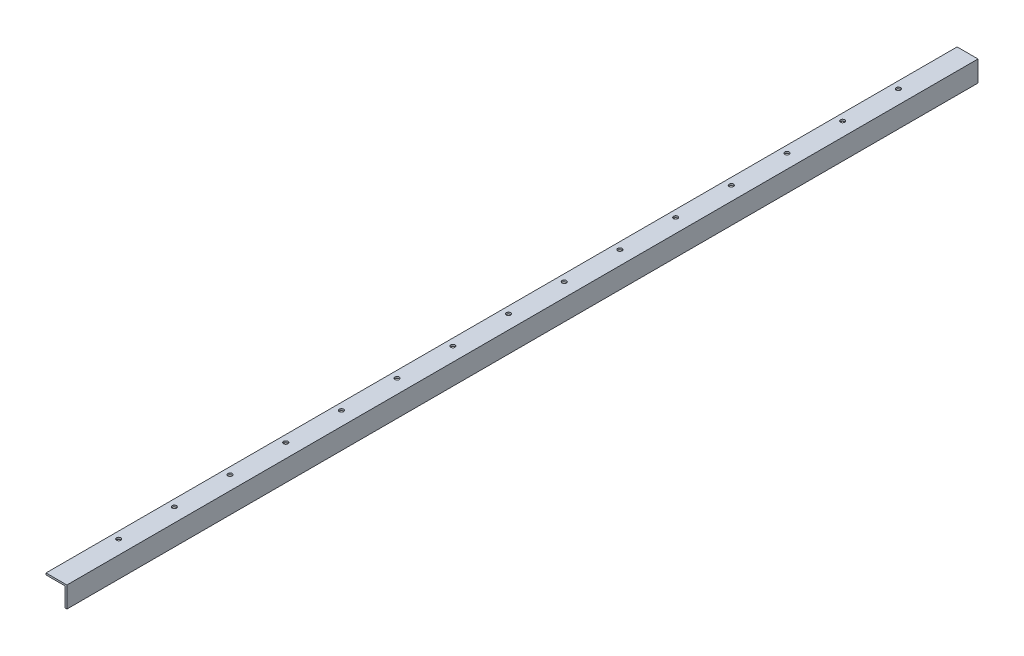
ISO-10303-21;
HEADER;
FILE_DESCRIPTION(('STEP AP214'),'2;1');
FILE_NAME('part.step','',(''),(''),'','','');
FILE_SCHEMA(('AUTOMOTIVE_DESIGN { 1 0 10303 214 1 1 1 1 }'));
ENDSEC;
DATA;
#1=APPLICATION_CONTEXT('core data for automotive mechanical design processes');
#2=APPLICATION_PROTOCOL_DEFINITION('international standard','automotive_design',2000,#1);
#3=PRODUCT_CONTEXT('',#1,'mechanical');
#4=PRODUCT('Part','Part','',(#3));
#5=PRODUCT_RELATED_PRODUCT_CATEGORY('part','',(#4));
#6=PRODUCT_DEFINITION_FORMATION('','',#4);
#7=PRODUCT_DEFINITION_CONTEXT('part definition',#1,'design');
#8=PRODUCT_DEFINITION('design','',#6,#7);
#9=PRODUCT_DEFINITION_SHAPE('','',#8);
#10=(LENGTH_UNIT() NAMED_UNIT(*) SI_UNIT(.MILLI.,.METRE.));
#11=(NAMED_UNIT(*) PLANE_ANGLE_UNIT() SI_UNIT($,.RADIAN.));
#12=(NAMED_UNIT(*) SI_UNIT($,.STERADIAN.) SOLID_ANGLE_UNIT());
#13=UNCERTAINTY_MEASURE_WITH_UNIT(LENGTH_MEASURE(1.E-05),#10,'distance_accuracy_value','');
#14=(GEOMETRIC_REPRESENTATION_CONTEXT(3) GLOBAL_UNCERTAINTY_ASSIGNED_CONTEXT((#13)) GLOBAL_UNIT_ASSIGNED_CONTEXT((#10,
#11,#12)) REPRESENTATION_CONTEXT('',''));
#15=CARTESIAN_POINT('',(0.,0.,0.));
#16=DIRECTION('',(0.,0.,1.));
#17=DIRECTION('',(1.,0.,0.));
#18=AXIS2_PLACEMENT_3D('',#15,#16,#17);
#19=CARTESIAN_POINT('',(-25.4,-41.275,1542.25625));
#20=DIRECTION('',(0.,1.,0.));
#21=DIRECTION('',(0.,0.,1.));
#22=AXIS2_PLACEMENT_3D('',#19,#20,#21);
#23=CYLINDRICAL_SURFACE('',#22,3.96874999999999);
#24=CARTESIAN_POINT('',(-25.4,-3.175,1542.25625));
#25=DIRECTION('',(0.,1.,0.));
#26=DIRECTION('',(0.,0.,1.));
#27=AXIS2_PLACEMENT_3D('',#24,#25,#26);
#28=CIRCLE('',#27,3.96874999999999);
#29=CARTESIAN_POINT('',(-25.4,-3.175,1546.225));
#30=VERTEX_POINT('',#29);
#31=EDGE_CURVE('E40',#30,#30,#28,.T.);
#32=ORIENTED_EDGE('',*,*,#31,.F.);
#33=EDGE_LOOP('',(#32));
#34=FACE_BOUND('',#33,.T.);
#35=CARTESIAN_POINT('',(-25.4,0.,1542.25625));
#36=DIRECTION('',(0.,-1.,0.));
#37=DIRECTION('',(1.,0.,0.));
#38=AXIS2_PLACEMENT_3D('',#35,#36,#37);
#39=CIRCLE('',#38,3.96874999999999);
#40=CARTESIAN_POINT('',(-21.43125,0.,1542.25625));
#41=VERTEX_POINT('',#40);
#42=EDGE_CURVE('E11',#41,#41,#39,.T.);
#43=ORIENTED_EDGE('',*,*,#42,.F.);
#44=EDGE_LOOP('',(#43));
#45=FACE_BOUND('',#44,.T.);
#46=ADVANCED_FACE('F32',(#34,#45),#23,.F.);
#47=CARTESIAN_POINT('',(-25.4,-41.275,1440.65625));
#48=DIRECTION('',(0.,1.,0.));
#49=DIRECTION('',(0.,0.,1.));
#50=AXIS2_PLACEMENT_3D('',#47,#48,#49);
#51=CYLINDRICAL_SURFACE('',#50,3.96874999999999);
#52=CARTESIAN_POINT('',(-25.4,-3.175,1440.65625));
#53=DIRECTION('',(0.,1.,0.));
#54=DIRECTION('',(0.,0.,1.));
#55=AXIS2_PLACEMENT_3D('',#52,#53,#54);
#56=CIRCLE('',#55,3.96874999999999);
#57=CARTESIAN_POINT('',(-25.4,-3.175,1444.625));
#58=VERTEX_POINT('',#57);
#59=EDGE_CURVE('E208',#58,#58,#56,.T.);
#60=ORIENTED_EDGE('',*,*,#59,.F.);
#61=EDGE_LOOP('',(#60));
#62=FACE_BOUND('',#61,.T.);
#63=CARTESIAN_POINT('',(-25.4,0.,1440.65625));
#64=DIRECTION('',(0.,-1.,0.));
#65=DIRECTION('',(1.,0.,0.));
#66=AXIS2_PLACEMENT_3D('',#63,#64,#65);
#67=CIRCLE('',#66,3.96874999999999);
#68=CARTESIAN_POINT('',(-21.43125,0.,1440.65625));
#69=VERTEX_POINT('',#68);
#70=EDGE_CURVE('E211',#69,#69,#67,.T.);
#71=ORIENTED_EDGE('',*,*,#70,.F.);
#72=EDGE_LOOP('',(#71));
#73=FACE_BOUND('',#72,.T.);
#74=ADVANCED_FACE('F219',(#62,#73),#51,.F.);
#75=CARTESIAN_POINT('',(-25.4,-41.275,1339.05625));
#76=DIRECTION('',(0.,1.,0.));
#77=DIRECTION('',(0.,0.,1.));
#78=AXIS2_PLACEMENT_3D('',#75,#76,#77);
#79=CYLINDRICAL_SURFACE('',#78,3.96874999999999);
#80=CARTESIAN_POINT('',(-25.4,-3.175,1339.05625));
#81=DIRECTION('',(0.,1.,0.));
#82=DIRECTION('',(0.,0.,1.));
#83=AXIS2_PLACEMENT_3D('',#80,#81,#82);
#84=CIRCLE('',#83,3.96874999999999);
#85=CARTESIAN_POINT('',(-25.4,-3.175,1343.025));
#86=VERTEX_POINT('',#85);
#87=EDGE_CURVE('E202',#86,#86,#84,.T.);
#88=ORIENTED_EDGE('',*,*,#87,.F.);
#89=EDGE_LOOP('',(#88));
#90=FACE_BOUND('',#89,.T.);
#91=CARTESIAN_POINT('',(-25.4,0.,1339.05625));
#92=DIRECTION('',(0.,-1.,0.));
#93=DIRECTION('',(1.,0.,0.));
#94=AXIS2_PLACEMENT_3D('',#91,#92,#93);
#95=CIRCLE('',#94,3.96874999999999);
#96=CARTESIAN_POINT('',(-21.43125,0.,1339.05625));
#97=VERTEX_POINT('',#96);
#98=EDGE_CURVE('E205',#97,#97,#95,.T.);
#99=ORIENTED_EDGE('',*,*,#98,.F.);
#100=EDGE_LOOP('',(#99));
#101=FACE_BOUND('',#100,.T.);
#102=ADVANCED_FACE('F279',(#90,#101),#79,.F.);
#103=CARTESIAN_POINT('',(-25.4,-41.275,1237.45625));
#104=DIRECTION('',(0.,1.,0.));
#105=DIRECTION('',(0.,0.,1.));
#106=AXIS2_PLACEMENT_3D('',#103,#104,#105);
#107=CYLINDRICAL_SURFACE('',#106,3.96874999999999);
#108=CARTESIAN_POINT('',(-25.4,-3.175,1237.45625));
#109=DIRECTION('',(0.,1.,0.));
#110=DIRECTION('',(0.,0.,1.));
#111=AXIS2_PLACEMENT_3D('',#108,#109,#110);
#112=CIRCLE('',#111,3.96874999999999);
#113=CARTESIAN_POINT('',(-25.4,-3.175,1241.425));
#114=VERTEX_POINT('',#113);
#115=EDGE_CURVE('E196',#114,#114,#112,.T.);
#116=ORIENTED_EDGE('',*,*,#115,.F.);
#117=EDGE_LOOP('',(#116));
#118=FACE_BOUND('',#117,.T.);
#119=CARTESIAN_POINT('',(-25.4,0.,1237.45625));
#120=DIRECTION('',(0.,-1.,0.));
#121=DIRECTION('',(1.,0.,0.));
#122=AXIS2_PLACEMENT_3D('',#119,#120,#121);
#123=CIRCLE('',#122,3.96874999999999);
#124=CARTESIAN_POINT('',(-21.43125,0.,1237.45625));
#125=VERTEX_POINT('',#124);
#126=EDGE_CURVE('E199',#125,#125,#123,.T.);
#127=ORIENTED_EDGE('',*,*,#126,.F.);
#128=EDGE_LOOP('',(#127));
#129=FACE_BOUND('',#128,.T.);
#130=ADVANCED_FACE('F275',(#118,#129),#107,.F.);
#131=CARTESIAN_POINT('',(-25.4,-41.275,1135.85625));
#132=DIRECTION('',(0.,1.,0.));
#133=DIRECTION('',(0.,0.,1.));
#134=AXIS2_PLACEMENT_3D('',#131,#132,#133);
#135=CYLINDRICAL_SURFACE('',#134,3.96874999999999);
#136=CARTESIAN_POINT('',(-25.4,-3.175,1135.85625));
#137=DIRECTION('',(0.,1.,0.));
#138=DIRECTION('',(0.,0.,1.));
#139=AXIS2_PLACEMENT_3D('',#136,#137,#138);
#140=CIRCLE('',#139,3.96874999999999);
#141=CARTESIAN_POINT('',(-25.4,-3.175,1139.825));
#142=VERTEX_POINT('',#141);
#143=EDGE_CURVE('E190',#142,#142,#140,.T.);
#144=ORIENTED_EDGE('',*,*,#143,.F.);
#145=EDGE_LOOP('',(#144));
#146=FACE_BOUND('',#145,.T.);
#147=CARTESIAN_POINT('',(-25.4,0.,1135.85625));
#148=DIRECTION('',(0.,-1.,0.));
#149=DIRECTION('',(1.,0.,0.));
#150=AXIS2_PLACEMENT_3D('',#147,#148,#149);
#151=CIRCLE('',#150,3.96874999999999);
#152=CARTESIAN_POINT('',(-21.43125,0.,1135.85625));
#153=VERTEX_POINT('',#152);
#154=EDGE_CURVE('E193',#153,#153,#151,.T.);
#155=ORIENTED_EDGE('',*,*,#154,.F.);
#156=EDGE_LOOP('',(#155));
#157=FACE_BOUND('',#156,.T.);
#158=ADVANCED_FACE('F271',(#146,#157),#135,.F.);
#159=CARTESIAN_POINT('',(-25.4,-41.275,1034.25625));
#160=DIRECTION('',(0.,1.,0.));
#161=DIRECTION('',(0.,0.,1.));
#162=AXIS2_PLACEMENT_3D('',#159,#160,#161);
#163=CYLINDRICAL_SURFACE('',#162,3.96874999999999);
#164=CARTESIAN_POINT('',(-25.4,-3.175,1034.25625));
#165=DIRECTION('',(0.,1.,0.));
#166=DIRECTION('',(0.,0.,1.));
#167=AXIS2_PLACEMENT_3D('',#164,#165,#166);
#168=CIRCLE('',#167,3.96874999999999);
#169=CARTESIAN_POINT('',(-25.4,-3.175,1038.225));
#170=VERTEX_POINT('',#169);
#171=EDGE_CURVE('E184',#170,#170,#168,.T.);
#172=ORIENTED_EDGE('',*,*,#171,.F.);
#173=EDGE_LOOP('',(#172));
#174=FACE_BOUND('',#173,.T.);
#175=CARTESIAN_POINT('',(-25.4,0.,1034.25625));
#176=DIRECTION('',(0.,-1.,0.));
#177=DIRECTION('',(1.,0.,0.));
#178=AXIS2_PLACEMENT_3D('',#175,#176,#177);
#179=CIRCLE('',#178,3.96874999999999);
#180=CARTESIAN_POINT('',(-21.43125,0.,1034.25625));
#181=VERTEX_POINT('',#180);
#182=EDGE_CURVE('E187',#181,#181,#179,.T.);
#183=ORIENTED_EDGE('',*,*,#182,.F.);
#184=EDGE_LOOP('',(#183));
#185=FACE_BOUND('',#184,.T.);
#186=ADVANCED_FACE('F267',(#174,#185),#163,.F.);
#187=CARTESIAN_POINT('',(-25.4,-41.275,932.65625));
#188=DIRECTION('',(0.,1.,0.));
#189=DIRECTION('',(0.,0.,1.));
#190=AXIS2_PLACEMENT_3D('',#187,#188,#189);
#191=CYLINDRICAL_SURFACE('',#190,3.96874999999999);
#192=CARTESIAN_POINT('',(-25.4,-3.175,932.65625));
#193=DIRECTION('',(0.,1.,0.));
#194=DIRECTION('',(0.,0.,1.));
#195=AXIS2_PLACEMENT_3D('',#192,#193,#194);
#196=CIRCLE('',#195,3.96874999999999);
#197=CARTESIAN_POINT('',(-25.4,-3.175,936.625));
#198=VERTEX_POINT('',#197);
#199=EDGE_CURVE('E178',#198,#198,#196,.T.);
#200=ORIENTED_EDGE('',*,*,#199,.F.);
#201=EDGE_LOOP('',(#200));
#202=FACE_BOUND('',#201,.T.);
#203=CARTESIAN_POINT('',(-25.4,0.,932.65625));
#204=DIRECTION('',(0.,-1.,0.));
#205=DIRECTION('',(1.,0.,0.));
#206=AXIS2_PLACEMENT_3D('',#203,#204,#205);
#207=CIRCLE('',#206,3.96874999999999);
#208=CARTESIAN_POINT('',(-21.43125,0.,932.65625));
#209=VERTEX_POINT('',#208);
#210=EDGE_CURVE('E181',#209,#209,#207,.T.);
#211=ORIENTED_EDGE('',*,*,#210,.F.);
#212=EDGE_LOOP('',(#211));
#213=FACE_BOUND('',#212,.T.);
#214=ADVANCED_FACE('F263',(#202,#213),#191,.F.);
#215=CARTESIAN_POINT('',(-25.4,-41.275,831.05625));
#216=DIRECTION('',(0.,1.,0.));
#217=DIRECTION('',(0.,0.,1.));
#218=AXIS2_PLACEMENT_3D('',#215,#216,#217);
#219=CYLINDRICAL_SURFACE('',#218,3.96874999999999);
#220=CARTESIAN_POINT('',(-25.4,-3.175,831.05625));
#221=DIRECTION('',(0.,1.,0.));
#222=DIRECTION('',(0.,0.,1.));
#223=AXIS2_PLACEMENT_3D('',#220,#221,#222);
#224=CIRCLE('',#223,3.96874999999999);
#225=CARTESIAN_POINT('',(-25.4,-3.175,835.025));
#226=VERTEX_POINT('',#225);
#227=EDGE_CURVE('E172',#226,#226,#224,.T.);
#228=ORIENTED_EDGE('',*,*,#227,.F.);
#229=EDGE_LOOP('',(#228));
#230=FACE_BOUND('',#229,.T.);
#231=CARTESIAN_POINT('',(-25.4,0.,831.05625));
#232=DIRECTION('',(0.,-1.,0.));
#233=DIRECTION('',(1.,0.,0.));
#234=AXIS2_PLACEMENT_3D('',#231,#232,#233);
#235=CIRCLE('',#234,3.96874999999999);
#236=CARTESIAN_POINT('',(-21.43125,0.,831.05625));
#237=VERTEX_POINT('',#236);
#238=EDGE_CURVE('E175',#237,#237,#235,.T.);
#239=ORIENTED_EDGE('',*,*,#238,.F.);
#240=EDGE_LOOP('',(#239));
#241=FACE_BOUND('',#240,.T.);
#242=ADVANCED_FACE('F259',(#230,#241),#219,.F.);
#243=CARTESIAN_POINT('',(-25.4,-41.275,729.45625));
#244=DIRECTION('',(0.,1.,0.));
#245=DIRECTION('',(0.,0.,1.));
#246=AXIS2_PLACEMENT_3D('',#243,#244,#245);
#247=CYLINDRICAL_SURFACE('',#246,3.96874999999999);
#248=CARTESIAN_POINT('',(-25.4,-3.175,729.45625));
#249=DIRECTION('',(0.,1.,0.));
#250=DIRECTION('',(0.,0.,1.));
#251=AXIS2_PLACEMENT_3D('',#248,#249,#250);
#252=CIRCLE('',#251,3.96874999999999);
#253=CARTESIAN_POINT('',(-25.4,-3.175,733.425));
#254=VERTEX_POINT('',#253);
#255=EDGE_CURVE('E166',#254,#254,#252,.T.);
#256=ORIENTED_EDGE('',*,*,#255,.F.);
#257=EDGE_LOOP('',(#256));
#258=FACE_BOUND('',#257,.T.);
#259=CARTESIAN_POINT('',(-25.4,0.,729.45625));
#260=DIRECTION('',(0.,-1.,0.));
#261=DIRECTION('',(1.,0.,0.));
#262=AXIS2_PLACEMENT_3D('',#259,#260,#261);
#263=CIRCLE('',#262,3.96874999999999);
#264=CARTESIAN_POINT('',(-21.43125,0.,729.45625));
#265=VERTEX_POINT('',#264);
#266=EDGE_CURVE('E169',#265,#265,#263,.T.);
#267=ORIENTED_EDGE('',*,*,#266,.F.);
#268=EDGE_LOOP('',(#267));
#269=FACE_BOUND('',#268,.T.);
#270=ADVANCED_FACE('F255',(#258,#269),#247,.F.);
#271=CARTESIAN_POINT('',(-25.4,-41.275,627.85625));
#272=DIRECTION('',(0.,1.,0.));
#273=DIRECTION('',(0.,0.,1.));
#274=AXIS2_PLACEMENT_3D('',#271,#272,#273);
#275=CYLINDRICAL_SURFACE('',#274,3.96874999999999);
#276=CARTESIAN_POINT('',(-25.4,-3.175,627.85625));
#277=DIRECTION('',(0.,1.,0.));
#278=DIRECTION('',(0.,0.,1.));
#279=AXIS2_PLACEMENT_3D('',#276,#277,#278);
#280=CIRCLE('',#279,3.96874999999999);
#281=CARTESIAN_POINT('',(-25.4,-3.175,631.825));
#282=VERTEX_POINT('',#281);
#283=EDGE_CURVE('E160',#282,#282,#280,.T.);
#284=ORIENTED_EDGE('',*,*,#283,.F.);
#285=EDGE_LOOP('',(#284));
#286=FACE_BOUND('',#285,.T.);
#287=CARTESIAN_POINT('',(-25.4,0.,627.85625));
#288=DIRECTION('',(0.,-1.,0.));
#289=DIRECTION('',(1.,0.,0.));
#290=AXIS2_PLACEMENT_3D('',#287,#288,#289);
#291=CIRCLE('',#290,3.96874999999999);
#292=CARTESIAN_POINT('',(-21.43125,0.,627.85625));
#293=VERTEX_POINT('',#292);
#294=EDGE_CURVE('E163',#293,#293,#291,.T.);
#295=ORIENTED_EDGE('',*,*,#294,.F.);
#296=EDGE_LOOP('',(#295));
#297=FACE_BOUND('',#296,.T.);
#298=ADVANCED_FACE('F251',(#286,#297),#275,.F.);
#299=CARTESIAN_POINT('',(-25.4,-41.275,526.25625));
#300=DIRECTION('',(0.,1.,0.));
#301=DIRECTION('',(0.,0.,1.));
#302=AXIS2_PLACEMENT_3D('',#299,#300,#301);
#303=CYLINDRICAL_SURFACE('',#302,3.96874999999999);
#304=CARTESIAN_POINT('',(-25.4,-3.175,526.25625));
#305=DIRECTION('',(0.,1.,0.));
#306=DIRECTION('',(0.,0.,1.));
#307=AXIS2_PLACEMENT_3D('',#304,#305,#306);
#308=CIRCLE('',#307,3.96874999999999);
#309=CARTESIAN_POINT('',(-25.4,-3.175,530.225));
#310=VERTEX_POINT('',#309);
#311=EDGE_CURVE('E154',#310,#310,#308,.T.);
#312=ORIENTED_EDGE('',*,*,#311,.F.);
#313=EDGE_LOOP('',(#312));
#314=FACE_BOUND('',#313,.T.);
#315=CARTESIAN_POINT('',(-25.4,0.,526.25625));
#316=DIRECTION('',(0.,-1.,0.));
#317=DIRECTION('',(1.,0.,0.));
#318=AXIS2_PLACEMENT_3D('',#315,#316,#317);
#319=CIRCLE('',#318,3.96874999999999);
#320=CARTESIAN_POINT('',(-21.43125,0.,526.25625));
#321=VERTEX_POINT('',#320);
#322=EDGE_CURVE('E157',#321,#321,#319,.T.);
#323=ORIENTED_EDGE('',*,*,#322,.F.);
#324=EDGE_LOOP('',(#323));
#325=FACE_BOUND('',#324,.T.);
#326=ADVANCED_FACE('F247',(#314,#325),#303,.F.);
#327=CARTESIAN_POINT('',(-25.4,-41.275,424.65625));
#328=DIRECTION('',(0.,1.,0.));
#329=DIRECTION('',(0.,0.,1.));
#330=AXIS2_PLACEMENT_3D('',#327,#328,#329);
#331=CYLINDRICAL_SURFACE('',#330,3.96874999999999);
#332=CARTESIAN_POINT('',(-25.4,-3.175,424.65625));
#333=DIRECTION('',(0.,1.,0.));
#334=DIRECTION('',(0.,0.,1.));
#335=AXIS2_PLACEMENT_3D('',#332,#333,#334);
#336=CIRCLE('',#335,3.96874999999999);
#337=CARTESIAN_POINT('',(-25.4,-3.175,428.625));
#338=VERTEX_POINT('',#337);
#339=EDGE_CURVE('E148',#338,#338,#336,.T.);
#340=ORIENTED_EDGE('',*,*,#339,.F.);
#341=EDGE_LOOP('',(#340));
#342=FACE_BOUND('',#341,.T.);
#343=CARTESIAN_POINT('',(-25.4,0.,424.65625));
#344=DIRECTION('',(0.,-1.,0.));
#345=DIRECTION('',(1.,0.,0.));
#346=AXIS2_PLACEMENT_3D('',#343,#344,#345);
#347=CIRCLE('',#346,3.96874999999999);
#348=CARTESIAN_POINT('',(-21.43125,0.,424.65625));
#349=VERTEX_POINT('',#348);
#350=EDGE_CURVE('E151',#349,#349,#347,.T.);
#351=ORIENTED_EDGE('',*,*,#350,.F.);
#352=EDGE_LOOP('',(#351));
#353=FACE_BOUND('',#352,.T.);
#354=ADVANCED_FACE('F243',(#342,#353),#331,.F.);
#355=CARTESIAN_POINT('',(-25.4,-41.275,323.05625));
#356=DIRECTION('',(0.,1.,0.));
#357=DIRECTION('',(0.,0.,1.));
#358=AXIS2_PLACEMENT_3D('',#355,#356,#357);
#359=CYLINDRICAL_SURFACE('',#358,3.96874999999999);
#360=CARTESIAN_POINT('',(-25.4,-3.175,323.05625));
#361=DIRECTION('',(0.,1.,0.));
#362=DIRECTION('',(0.,0.,1.));
#363=AXIS2_PLACEMENT_3D('',#360,#361,#362);
#364=CIRCLE('',#363,3.96874999999999);
#365=CARTESIAN_POINT('',(-25.4,-3.175,327.025));
#366=VERTEX_POINT('',#365);
#367=EDGE_CURVE('E138',#366,#366,#364,.T.);
#368=ORIENTED_EDGE('',*,*,#367,.F.);
#369=EDGE_LOOP('',(#368));
#370=FACE_BOUND('',#369,.T.);
#371=CARTESIAN_POINT('',(-25.4,0.,323.05625));
#372=DIRECTION('',(0.,-1.,0.));
#373=DIRECTION('',(1.,0.,0.));
#374=AXIS2_PLACEMENT_3D('',#371,#372,#373);
#375=CIRCLE('',#374,3.96874999999999);
#376=CARTESIAN_POINT('',(-21.43125,0.,323.05625));
#377=VERTEX_POINT('',#376);
#378=EDGE_CURVE('E145',#377,#377,#375,.T.);
#379=ORIENTED_EDGE('',*,*,#378,.F.);
#380=EDGE_LOOP('',(#379));
#381=FACE_BOUND('',#380,.T.);
#382=ADVANCED_FACE('F234',(#370,#381),#359,.F.);
#383=CARTESIAN_POINT('',(0.,-38.1,1662.1125));
#384=DIRECTION('',(-1.,0.,0.));
#385=DIRECTION('',(0.,0.,1.));
#386=AXIS2_PLACEMENT_3D('',#383,#384,#385);
#387=PLANE('',#386);
#388=DIRECTION('',(0.,1.,0.));
#389=VECTOR('',#388,1.);
#390=CARTESIAN_POINT('',(0.,-38.1,0.));
#391=LINE('',#390,#389);
#392=CARTESIAN_POINT('',(0.,-38.1,0.));
#393=VERTEX_POINT('',#392);
#394=CARTESIAN_POINT('',(0.,0.,0.));
#395=VERTEX_POINT('',#394);
#396=EDGE_CURVE('E118',#393,#395,#391,.T.);
#397=ORIENTED_EDGE('',*,*,#396,.T.);
#398=DIRECTION('',(0.,0.,-1.));
#399=VECTOR('',#398,1.);
#400=CARTESIAN_POINT('',(0.,0.,1662.1125));
#401=LINE('',#400,#399);
#402=CARTESIAN_POINT('',(0.,0.,1662.1125));
#403=VERTEX_POINT('',#402);
#404=EDGE_CURVE('E136',#403,#395,#401,.T.);
#405=ORIENTED_EDGE('',*,*,#404,.F.);
#406=DIRECTION('',(0.,1.,0.));
#407=VECTOR('',#406,1.);
#408=CARTESIAN_POINT('',(0.,-38.1,1662.1125));
#409=LINE('',#408,#407);
#410=CARTESIAN_POINT('',(0.,-38.1,1662.1125));
#411=VERTEX_POINT('',#410);
#412=EDGE_CURVE('E129',#411,#403,#409,.T.);
#413=ORIENTED_EDGE('',*,*,#412,.F.);
#414=DIRECTION('',(0.,0.,-1.));
#415=VECTOR('',#414,1.);
#416=CARTESIAN_POINT('',(0.,-38.1,1662.1125));
#417=LINE('',#416,#415);
#418=EDGE_CURVE('E114',#411,#393,#417,.T.);
#419=ORIENTED_EDGE('',*,*,#418,.T.);
#420=EDGE_LOOP('',(#397,#405,#413,#419));
#421=FACE_BOUND('',#420,.T.);
#422=ADVANCED_FACE('F225',(#421),#387,.F.);
#423=CARTESIAN_POINT('',(0.,0.,1662.1125));
#424=DIRECTION('',(0.,-1.,0.));
#425=DIRECTION('',(1.,0.,0.));
#426=AXIS2_PLACEMENT_3D('',#423,#424,#425);
#427=PLANE('',#426);
#428=CARTESIAN_POINT('',(-25.4,0.,221.45625));
#429=DIRECTION('',(0.,-1.,0.));
#430=DIRECTION('',(1.,0.,0.));
#431=AXIS2_PLACEMENT_3D('',#428,#429,#430);
#432=CIRCLE('',#431,3.96874999999999);
#433=CARTESIAN_POINT('',(-21.43125,0.,221.45625));
#434=VERTEX_POINT('',#433);
#435=EDGE_CURVE('E142',#434,#434,#432,.T.);
#436=ORIENTED_EDGE('',*,*,#435,.T.);
#437=EDGE_LOOP('',(#436));
#438=FACE_BOUND('',#437,.T.);
#439=CARTESIAN_POINT('',(-25.4,0.,119.85625));
#440=DIRECTION('',(0.,-1.,0.));
#441=DIRECTION('',(1.,0.,0.));
#442=AXIS2_PLACEMENT_3D('',#439,#440,#441);
#443=CIRCLE('',#442,3.96874999999999);
#444=CARTESIAN_POINT('',(-21.43125,0.,119.85625));
#445=VERTEX_POINT('',#444);
#446=EDGE_CURVE('E122',#445,#445,#443,.T.);
#447=ORIENTED_EDGE('',*,*,#446,.T.);
#448=EDGE_LOOP('',(#447));
#449=FACE_BOUND('',#448,.T.);
#450=DIRECTION('',(-1.,0.,0.));
#451=VECTOR('',#450,1.);
#452=CARTESIAN_POINT('',(0.,0.,0.));
#453=LINE('',#452,#451);
#454=CARTESIAN_POINT('',(-38.1,0.,0.));
#455=VERTEX_POINT('',#454);
#456=EDGE_CURVE('E121',#395,#455,#453,.T.);
#457=ORIENTED_EDGE('',*,*,#456,.T.);
#458=DIRECTION('',(0.,0.,-1.));
#459=VECTOR('',#458,1.);
#460=CARTESIAN_POINT('',(-38.1,0.,1662.1125));
#461=LINE('',#460,#459);
#462=CARTESIAN_POINT('',(-38.1,0.,1662.1125));
#463=VERTEX_POINT('',#462);
#464=EDGE_CURVE('E133',#463,#455,#461,.T.);
#465=ORIENTED_EDGE('',*,*,#464,.F.);
#466=DIRECTION('',(-1.,0.,0.));
#467=VECTOR('',#466,1.);
#468=CARTESIAN_POINT('',(0.,0.,1662.1125));
#469=LINE('',#468,#467);
#470=EDGE_CURVE('E86',#403,#463,#469,.T.);
#471=ORIENTED_EDGE('',*,*,#470,.F.);
#472=ORIENTED_EDGE('',*,*,#404,.T.);
#473=EDGE_LOOP('',(#457,#465,#471,#472));
#474=FACE_BOUND('',#473,.T.);
#475=ORIENTED_EDGE('',*,*,#378,.T.);
#476=EDGE_LOOP('',(#475));
#477=FACE_BOUND('',#476,.T.);
#478=ORIENTED_EDGE('',*,*,#350,.T.);
#479=EDGE_LOOP('',(#478));
#480=FACE_BOUND('',#479,.T.);
#481=ORIENTED_EDGE('',*,*,#322,.T.);
#482=EDGE_LOOP('',(#481));
#483=FACE_BOUND('',#482,.T.);
#484=ORIENTED_EDGE('',*,*,#294,.T.);
#485=EDGE_LOOP('',(#484));
#486=FACE_BOUND('',#485,.T.);
#487=ORIENTED_EDGE('',*,*,#266,.T.);
#488=EDGE_LOOP('',(#487));
#489=FACE_BOUND('',#488,.T.);
#490=ORIENTED_EDGE('',*,*,#238,.T.);
#491=EDGE_LOOP('',(#490));
#492=FACE_BOUND('',#491,.T.);
#493=ORIENTED_EDGE('',*,*,#210,.T.);
#494=EDGE_LOOP('',(#493));
#495=FACE_BOUND('',#494,.T.);
#496=ORIENTED_EDGE('',*,*,#182,.T.);
#497=EDGE_LOOP('',(#496));
#498=FACE_BOUND('',#497,.T.);
#499=ORIENTED_EDGE('',*,*,#154,.T.);
#500=EDGE_LOOP('',(#499));
#501=FACE_BOUND('',#500,.T.);
#502=ORIENTED_EDGE('',*,*,#126,.T.);
#503=EDGE_LOOP('',(#502));
#504=FACE_BOUND('',#503,.T.);
#505=ORIENTED_EDGE('',*,*,#98,.T.);
#506=EDGE_LOOP('',(#505));
#507=FACE_BOUND('',#506,.T.);
#508=ORIENTED_EDGE('',*,*,#70,.T.);
#509=EDGE_LOOP('',(#508));
#510=FACE_BOUND('',#509,.T.);
#511=ORIENTED_EDGE('',*,*,#42,.T.);
#512=EDGE_LOOP('',(#511));
#513=FACE_BOUND('',#512,.T.);
#514=ADVANCED_FACE('F222',(#438,#449,#474,#477,#480,#483,#486,#489,#492,#495,#498,#501,#504,
#507,#510,#513),#427,.F.);
#515=CARTESIAN_POINT('',(-38.1,0.,1662.1125));
#516=DIRECTION('',(1.,0.,0.));
#517=DIRECTION('',(0.,0.,-1.));
#518=AXIS2_PLACEMENT_3D('',#515,#516,#517);
#519=PLANE('',#518);
#520=DIRECTION('',(0.,-1.,0.));
#521=VECTOR('',#520,1.);
#522=CARTESIAN_POINT('',(-38.1,0.,0.));
#523=LINE('',#522,#521);
#524=CARTESIAN_POINT('',(-38.1,-3.17500000000001,0.));
#525=VERTEX_POINT('',#524);
#526=EDGE_CURVE('E124',#455,#525,#523,.T.);
#527=ORIENTED_EDGE('',*,*,#526,.T.);
#528=DIRECTION('',(0.,0.,-1.));
#529=VECTOR('',#528,1.);
#530=CARTESIAN_POINT('',(-38.1,-3.17500000000001,1662.1125));
#531=LINE('',#530,#529);
#532=CARTESIAN_POINT('',(-38.1,-3.17500000000001,1662.1125));
#533=VERTEX_POINT('',#532);
#534=EDGE_CURVE('E109',#533,#525,#531,.T.);
#535=ORIENTED_EDGE('',*,*,#534,.F.);
#536=DIRECTION('',(0.,-1.,0.));
#537=VECTOR('',#536,1.);
#538=CARTESIAN_POINT('',(-38.1,0.,1662.1125));
#539=LINE('',#538,#537);
#540=EDGE_CURVE('E99',#463,#533,#539,.T.);
#541=ORIENTED_EDGE('',*,*,#540,.F.);
#542=ORIENTED_EDGE('',*,*,#464,.T.);
#543=EDGE_LOOP('',(#527,#535,#541,#542));
#544=FACE_BOUND('',#543,.T.);
#545=ADVANCED_FACE('F224',(#544),#519,.F.);
#546=CARTESIAN_POINT('',(-38.1,-3.17500000000001,1662.1125));
#547=DIRECTION('',(0.,1.,0.));
#548=DIRECTION('',(0.,0.,1.));
#549=AXIS2_PLACEMENT_3D('',#546,#547,#548);
#550=PLANE('',#549);
#551=CARTESIAN_POINT('',(-25.4,-3.175,221.45625));
#552=DIRECTION('',(0.,1.,0.));
#553=DIRECTION('',(0.,0.,1.));
#554=AXIS2_PLACEMENT_3D('',#551,#552,#553);
#555=CIRCLE('',#554,3.96874999999999);
#556=CARTESIAN_POINT('',(-25.4,-3.175,225.425));
#557=VERTEX_POINT('',#556);
#558=EDGE_CURVE('E321',#557,#557,#555,.T.);
#559=ORIENTED_EDGE('',*,*,#558,.T.);
#560=EDGE_LOOP('',(#559));
#561=FACE_BOUND('',#560,.T.);
#562=CARTESIAN_POINT('',(-25.4,-3.175,119.85625));
#563=DIRECTION('',(0.,1.,0.));
#564=DIRECTION('',(0.,0.,1.));
#565=AXIS2_PLACEMENT_3D('',#562,#563,#564);
#566=CIRCLE('',#565,3.96874999999999);
#567=CARTESIAN_POINT('',(-25.4,-3.175,123.825));
#568=VERTEX_POINT('',#567);
#569=EDGE_CURVE('E139',#568,#568,#566,.T.);
#570=ORIENTED_EDGE('',*,*,#569,.T.);
#571=EDGE_LOOP('',(#570));
#572=FACE_BOUND('',#571,.T.);
#573=DIRECTION('',(1.,0.,0.));
#574=VECTOR('',#573,1.);
#575=CARTESIAN_POINT('',(-38.1,-3.17500000000001,0.));
#576=LINE('',#575,#574);
#577=CARTESIAN_POINT('',(-3.17500000000001,-3.17500000000001,0.));
#578=VERTEX_POINT('',#577);
#579=EDGE_CURVE('E108',#525,#578,#576,.T.);
#580=ORIENTED_EDGE('',*,*,#579,.T.);
#581=DIRECTION('',(0.,0.,-1.));
#582=VECTOR('',#581,1.);
#583=CARTESIAN_POINT('',(-3.17500000000001,-3.17500000000001,1662.1125));
#584=LINE('',#583,#582);
#585=CARTESIAN_POINT('',(-3.17500000000001,-3.17500000000001,1662.1125));
#586=VERTEX_POINT('',#585);
#587=EDGE_CURVE('E104',#586,#578,#584,.T.);
#588=ORIENTED_EDGE('',*,*,#587,.F.);
#589=DIRECTION('',(1.,0.,0.));
#590=VECTOR('',#589,1.);
#591=CARTESIAN_POINT('',(-38.1,-3.17500000000001,1662.1125));
#592=LINE('',#591,#590);
#593=EDGE_CURVE('E93',#533,#586,#592,.T.);
#594=ORIENTED_EDGE('',*,*,#593,.F.);
#595=ORIENTED_EDGE('',*,*,#534,.T.);
#596=EDGE_LOOP('',(#580,#588,#594,#595));
#597=FACE_BOUND('',#596,.T.);
#598=ORIENTED_EDGE('',*,*,#367,.T.);
#599=EDGE_LOOP('',(#598));
#600=FACE_BOUND('',#599,.T.);
#601=ORIENTED_EDGE('',*,*,#339,.T.);
#602=EDGE_LOOP('',(#601));
#603=FACE_BOUND('',#602,.T.);
#604=ORIENTED_EDGE('',*,*,#311,.T.);
#605=EDGE_LOOP('',(#604));
#606=FACE_BOUND('',#605,.T.);
#607=ORIENTED_EDGE('',*,*,#283,.T.);
#608=EDGE_LOOP('',(#607));
#609=FACE_BOUND('',#608,.T.);
#610=ORIENTED_EDGE('',*,*,#255,.T.);
#611=EDGE_LOOP('',(#610));
#612=FACE_BOUND('',#611,.T.);
#613=ORIENTED_EDGE('',*,*,#227,.T.);
#614=EDGE_LOOP('',(#613));
#615=FACE_BOUND('',#614,.T.);
#616=ORIENTED_EDGE('',*,*,#199,.T.);
#617=EDGE_LOOP('',(#616));
#618=FACE_BOUND('',#617,.T.);
#619=ORIENTED_EDGE('',*,*,#171,.T.);
#620=EDGE_LOOP('',(#619));
#621=FACE_BOUND('',#620,.T.);
#622=ORIENTED_EDGE('',*,*,#143,.T.);
#623=EDGE_LOOP('',(#622));
#624=FACE_BOUND('',#623,.T.);
#625=ORIENTED_EDGE('',*,*,#115,.T.);
#626=EDGE_LOOP('',(#625));
#627=FACE_BOUND('',#626,.T.);
#628=ORIENTED_EDGE('',*,*,#87,.T.);
#629=EDGE_LOOP('',(#628));
#630=FACE_BOUND('',#629,.T.);
#631=ORIENTED_EDGE('',*,*,#59,.T.);
#632=EDGE_LOOP('',(#631));
#633=FACE_BOUND('',#632,.T.);
#634=ORIENTED_EDGE('',*,*,#31,.T.);
#635=EDGE_LOOP('',(#634));
#636=FACE_BOUND('',#635,.T.);
#637=ADVANCED_FACE('F105',(#561,#572,#597,#600,#603,#606,#609,#612,#615,#618,#621,#624,#627,
#630,#633,#636),#550,.F.);
#638=CARTESIAN_POINT('',(-3.17500000000001,-3.17500000000001,1662.1125));
#639=DIRECTION('',(1.,0.,0.));
#640=DIRECTION('',(0.,1.,0.));
#641=AXIS2_PLACEMENT_3D('',#638,#639,#640);
#642=PLANE('',#641);
#643=DIRECTION('',(0.,-1.,0.));
#644=VECTOR('',#643,1.);
#645=CARTESIAN_POINT('',(-3.17500000000001,-3.17500000000001,0.));
#646=LINE('',#645,#644);
#647=CARTESIAN_POINT('',(-3.175,-38.1,0.));
#648=VERTEX_POINT('',#647);
#649=EDGE_CURVE('E71',#578,#648,#646,.T.);
#650=ORIENTED_EDGE('',*,*,#649,.T.);
#651=DIRECTION('',(0.,0.,-1.));
#652=VECTOR('',#651,1.);
#653=CARTESIAN_POINT('',(-3.175,-38.1,1662.1125));
#654=LINE('',#653,#652);
#655=CARTESIAN_POINT('',(-3.175,-38.1,1662.1125));
#656=VERTEX_POINT('',#655);
#657=EDGE_CURVE('E110',#656,#648,#654,.T.);
#658=ORIENTED_EDGE('',*,*,#657,.F.);
#659=DIRECTION('',(0.,-1.,0.));
#660=VECTOR('',#659,1.);
#661=CARTESIAN_POINT('',(-3.17500000000001,-3.17500000000001,1662.1125));
#662=LINE('',#661,#660);
#663=EDGE_CURVE('E97',#586,#656,#662,.T.);
#664=ORIENTED_EDGE('',*,*,#663,.F.);
#665=ORIENTED_EDGE('',*,*,#587,.T.);
#666=EDGE_LOOP('',(#650,#658,#664,#665));
#667=FACE_BOUND('',#666,.T.);
#668=ADVANCED_FACE('F112',(#667),#642,.F.);
#669=CARTESIAN_POINT('',(-3.175,-38.1,1662.1125));
#670=DIRECTION('',(0.,1.,0.));
#671=DIRECTION('',(0.,0.,1.));
#672=AXIS2_PLACEMENT_3D('',#669,#670,#671);
#673=PLANE('',#672);
#674=DIRECTION('',(1.,0.,0.));
#675=VECTOR('',#674,1.);
#676=CARTESIAN_POINT('',(-3.175,-38.1,0.));
#677=LINE('',#676,#675);
#678=EDGE_CURVE('E77',#648,#393,#677,.T.);
#679=ORIENTED_EDGE('',*,*,#678,.T.);
#680=ORIENTED_EDGE('',*,*,#418,.F.);
#681=DIRECTION('',(1.,0.,0.));
#682=VECTOR('',#681,1.);
#683=CARTESIAN_POINT('',(-3.175,-38.1,1662.1125));
#684=LINE('',#683,#682);
#685=EDGE_CURVE('E48',#656,#411,#684,.T.);
#686=ORIENTED_EDGE('',*,*,#685,.F.);
#687=ORIENTED_EDGE('',*,*,#657,.T.);
#688=EDGE_LOOP('',(#679,#680,#686,#687));
#689=FACE_BOUND('',#688,.T.);
#690=ADVANCED_FACE('F297',(#689),#673,.F.);
#691=CARTESIAN_POINT('',(0.,0.,1662.1125));
#692=DIRECTION('',(0.,0.,1.));
#693=DIRECTION('',(1.,0.,0.));
#694=AXIS2_PLACEMENT_3D('',#691,#692,#693);
#695=PLANE('',#694);
#696=ORIENTED_EDGE('',*,*,#412,.T.);
#697=ORIENTED_EDGE('',*,*,#470,.T.);
#698=ORIENTED_EDGE('',*,*,#540,.T.);
#699=ORIENTED_EDGE('',*,*,#593,.T.);
#700=ORIENTED_EDGE('',*,*,#663,.T.);
#701=ORIENTED_EDGE('',*,*,#685,.T.);
#702=EDGE_LOOP('',(#696,#697,#698,#699,#700,#701));
#703=FACE_BOUND('',#702,.T.);
#704=ADVANCED_FACE('F95',(#703),#695,.T.);
#705=CARTESIAN_POINT('',(0.,0.,0.));
#706=DIRECTION('',(0.,0.,1.));
#707=DIRECTION('',(1.,0.,0.));
#708=AXIS2_PLACEMENT_3D('',#705,#706,#707);
#709=PLANE('',#708);
#710=ORIENTED_EDGE('',*,*,#396,.F.);
#711=ORIENTED_EDGE('',*,*,#678,.F.);
#712=ORIENTED_EDGE('',*,*,#649,.F.);
#713=ORIENTED_EDGE('',*,*,#579,.F.);
#714=ORIENTED_EDGE('',*,*,#526,.F.);
#715=ORIENTED_EDGE('',*,*,#456,.F.);
#716=EDGE_LOOP('',(#710,#711,#712,#713,#714,#715));
#717=FACE_BOUND('',#716,.T.);
#718=ADVANCED_FACE('F304',(#717),#709,.F.);
#719=CARTESIAN_POINT('',(-25.4,-41.275,119.85625));
#720=DIRECTION('',(0.,1.,0.));
#721=DIRECTION('',(0.,0.,1.));
#722=AXIS2_PLACEMENT_3D('',#719,#720,#721);
#723=CYLINDRICAL_SURFACE('',#722,3.96874999999999);
#724=ORIENTED_EDGE('',*,*,#569,.F.);
#725=EDGE_LOOP('',(#724));
#726=FACE_BOUND('',#725,.T.);
#727=ORIENTED_EDGE('',*,*,#446,.F.);
#728=EDGE_LOOP('',(#727));
#729=FACE_BOUND('',#728,.T.);
#730=ADVANCED_FACE('F307',(#726,#729),#723,.F.);
#731=CARTESIAN_POINT('',(-25.4,-41.275,221.45625));
#732=DIRECTION('',(0.,1.,0.));
#733=DIRECTION('',(0.,0.,1.));
#734=AXIS2_PLACEMENT_3D('',#731,#732,#733);
#735=CYLINDRICAL_SURFACE('',#734,3.96874999999999);
#736=ORIENTED_EDGE('',*,*,#558,.F.);
#737=EDGE_LOOP('',(#736));
#738=FACE_BOUND('',#737,.T.);
#739=ORIENTED_EDGE('',*,*,#435,.F.);
#740=EDGE_LOOP('',(#739));
#741=FACE_BOUND('',#740,.T.);
#742=ADVANCED_FACE('F313',(#738,#741),#735,.F.);
#743=CLOSED_SHELL('',(#46,#74,#102,#130,#158,#186,#214,#242,#270,#298,#326,#354,#382,#422,#514,
#545,#637,#668,#690,#704,#718,#730,#742));
#744=MANIFOLD_SOLID_BREP('B2',#743);
#745=ADVANCED_BREP_SHAPE_REPRESENTATION('',(#18,#744),#14);
#746=SHAPE_DEFINITION_REPRESENTATION(#9,#745);
ENDSEC;
END-ISO-10303-21;
